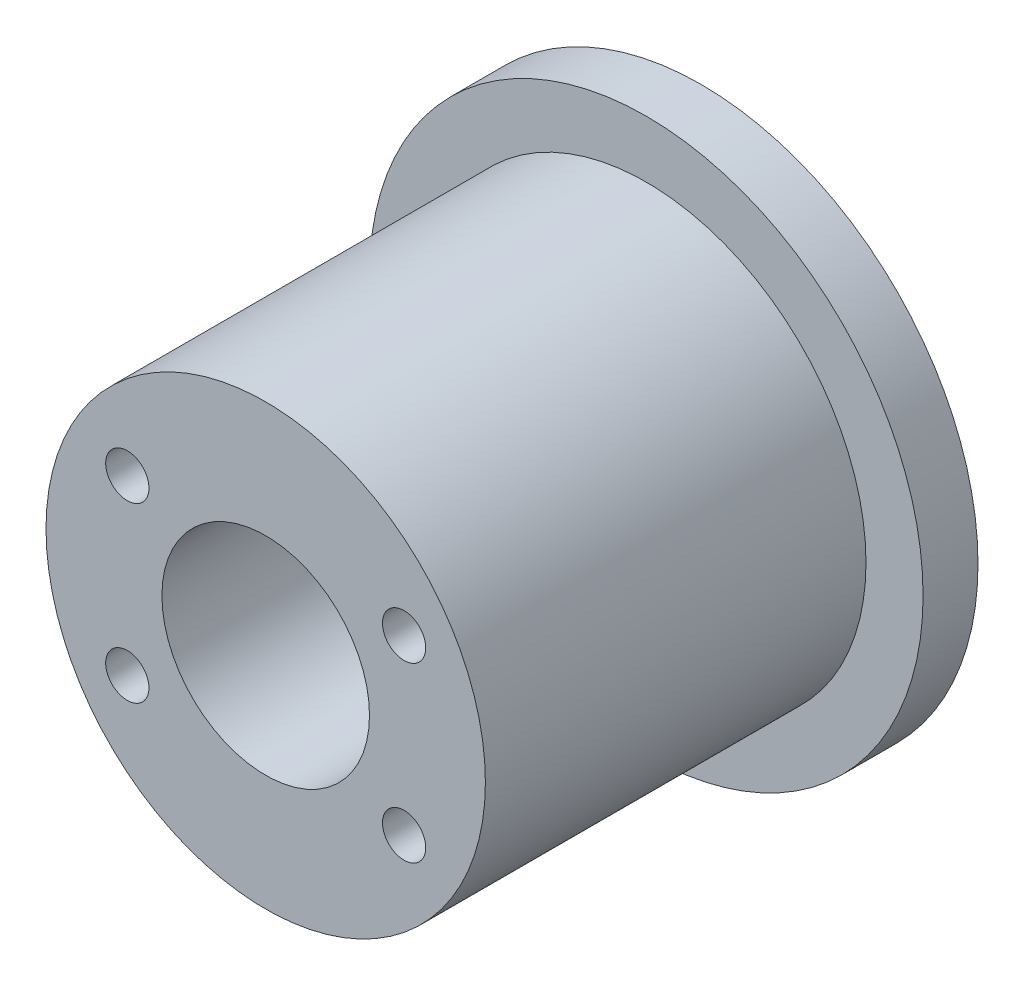
ISO-10303-21;
HEADER;
FILE_DESCRIPTION(('STEP AP214'),'2;1');
FILE_NAME('part.step','',(''),(''),'','','');
FILE_SCHEMA(('AUTOMOTIVE_DESIGN { 1 0 10303 214 1 1 1 1 }'));
ENDSEC;
DATA;
#1=APPLICATION_CONTEXT('core data for automotive mechanical design processes');
#2=APPLICATION_PROTOCOL_DEFINITION('international standard','automotive_design',2000,#1);
#3=PRODUCT_CONTEXT('',#1,'mechanical');
#4=PRODUCT('Part','Part','',(#3));
#5=PRODUCT_RELATED_PRODUCT_CATEGORY('part','',(#4));
#6=PRODUCT_DEFINITION_FORMATION('','',#4);
#7=PRODUCT_DEFINITION_CONTEXT('part definition',#1,'design');
#8=PRODUCT_DEFINITION('design','',#6,#7);
#9=PRODUCT_DEFINITION_SHAPE('','',#8);
#10=(LENGTH_UNIT() NAMED_UNIT(*) SI_UNIT(.MILLI.,.METRE.));
#11=(NAMED_UNIT(*) PLANE_ANGLE_UNIT() SI_UNIT($,.RADIAN.));
#12=(NAMED_UNIT(*) SI_UNIT($,.STERADIAN.) SOLID_ANGLE_UNIT());
#13=UNCERTAINTY_MEASURE_WITH_UNIT(LENGTH_MEASURE(1.E-05),#10,'distance_accuracy_value','');
#14=(GEOMETRIC_REPRESENTATION_CONTEXT(3) GLOBAL_UNCERTAINTY_ASSIGNED_CONTEXT((#13)) GLOBAL_UNIT_ASSIGNED_CONTEXT((#10,
#11,#12)) REPRESENTATION_CONTEXT('',''));
#15=CARTESIAN_POINT('',(0.,0.,0.));
#16=DIRECTION('',(0.,0.,1.));
#17=DIRECTION('',(1.,0.,0.));
#18=AXIS2_PLACEMENT_3D('',#15,#16,#17);
#19=CARTESIAN_POINT('',(0.,0.,11.));
#20=DIRECTION('',(0.,0.,1.));
#21=DIRECTION('',(1.,0.,0.));
#22=AXIS2_PLACEMENT_3D('',#19,#20,#21);
#23=PLANE('',#22);
#24=CARTESIAN_POINT('',(-8.,5.,11.));
#25=DIRECTION('',(0.,0.,1.));
#26=DIRECTION('',(1.,0.,0.));
#27=AXIS2_PLACEMENT_3D('',#24,#25,#26);
#28=CIRCLE('',#27,1.24999999999999);
#29=CARTESIAN_POINT('',(-6.75000000000002,5.,11.));
#30=VERTEX_POINT('',#29);
#31=EDGE_CURVE('E84',#30,#30,#28,.T.);
#32=ORIENTED_EDGE('',*,*,#31,.F.);
#33=EDGE_LOOP('',(#32));
#34=FACE_BOUND('',#33,.T.);
#35=CARTESIAN_POINT('',(-8.,-5.,11.));
#36=DIRECTION('',(0.,0.,1.));
#37=DIRECTION('',(1.,0.,0.));
#38=AXIS2_PLACEMENT_3D('',#35,#36,#37);
#39=CIRCLE('',#38,1.24999999999999);
#40=CARTESIAN_POINT('',(-6.75000000000001,-5.,11.));
#41=VERTEX_POINT('',#40);
#42=EDGE_CURVE('E83',#41,#41,#39,.T.);
#43=ORIENTED_EDGE('',*,*,#42,.F.);
#44=EDGE_LOOP('',(#43));
#45=FACE_BOUND('',#44,.T.);
#46=CARTESIAN_POINT('',(8.,-5.,11.));
#47=DIRECTION('',(0.,0.,1.));
#48=DIRECTION('',(1.,0.,0.));
#49=AXIS2_PLACEMENT_3D('',#46,#47,#48);
#50=CIRCLE('',#49,1.24999999999999);
#51=CARTESIAN_POINT('',(9.24999999999999,-5.,11.));
#52=VERTEX_POINT('',#51);
#53=EDGE_CURVE('E94',#52,#52,#50,.T.);
#54=ORIENTED_EDGE('',*,*,#53,.F.);
#55=EDGE_LOOP('',(#54));
#56=FACE_BOUND('',#55,.T.);
#57=CARTESIAN_POINT('',(8.,5.,11.));
#58=DIRECTION('',(0.,0.,1.));
#59=DIRECTION('',(1.,0.,0.));
#60=AXIS2_PLACEMENT_3D('',#57,#58,#59);
#61=CIRCLE('',#60,1.24999999999999);
#62=CARTESIAN_POINT('',(9.24999999999999,5.,11.));
#63=VERTEX_POINT('',#62);
#64=EDGE_CURVE('E100',#63,#63,#61,.T.);
#65=ORIENTED_EDGE('',*,*,#64,.F.);
#66=EDGE_LOOP('',(#65));
#67=FACE_BOUND('',#66,.T.);
#68=CARTESIAN_POINT('',(0.,0.,11.));
#69=DIRECTION('',(0.,0.,1.));
#70=DIRECTION('',(1.,0.,0.));
#71=AXIS2_PLACEMENT_3D('',#68,#69,#70);
#72=CIRCLE('',#71,12.7);
#73=CARTESIAN_POINT('',(12.7,0.,11.));
#74=VERTEX_POINT('',#73);
#75=EDGE_CURVE('E11',#74,#74,#72,.T.);
#76=ORIENTED_EDGE('',*,*,#75,.T.);
#77=EDGE_LOOP('',(#76));
#78=FACE_BOUND('',#77,.T.);
#79=CARTESIAN_POINT('',(0.,0.,11.));
#80=DIRECTION('',(0.,0.,1.));
#81=DIRECTION('',(1.,0.,0.));
#82=AXIS2_PLACEMENT_3D('',#79,#80,#81);
#83=CIRCLE('',#82,6.);
#84=CARTESIAN_POINT('',(6.,0.,11.));
#85=VERTEX_POINT('',#84);
#86=EDGE_CURVE('E60',#85,#85,#83,.T.);
#87=ORIENTED_EDGE('',*,*,#86,.F.);
#88=EDGE_LOOP('',(#87));
#89=FACE_BOUND('',#88,.T.);
#90=ADVANCED_FACE('F51',(#34,#45,#56,#67,#78,#89),#23,.T.);
#91=CARTESIAN_POINT('',(0.,0.,11.));
#92=DIRECTION('',(0.,0.,-1.));
#93=DIRECTION('',(-1.,0.,0.));
#94=AXIS2_PLACEMENT_3D('',#91,#92,#93);
#95=CYLINDRICAL_SURFACE('',#94,12.7);
#96=ORIENTED_EDGE('',*,*,#75,.F.);
#97=EDGE_LOOP('',(#96));
#98=FACE_BOUND('',#97,.T.);
#99=CARTESIAN_POINT('',(0.,0.,-11.));
#100=DIRECTION('',(0.,0.,1.));
#101=DIRECTION('',(1.,0.,0.));
#102=AXIS2_PLACEMENT_3D('',#99,#100,#101);
#103=CIRCLE('',#102,12.7);
#104=CARTESIAN_POINT('',(12.7,0.,-11.));
#105=VERTEX_POINT('',#104);
#106=EDGE_CURVE('E55',#105,#105,#103,.T.);
#107=ORIENTED_EDGE('',*,*,#106,.T.);
#108=EDGE_LOOP('',(#107));
#109=FACE_BOUND('',#108,.T.);
#110=ADVANCED_FACE('F53',(#98,#109),#95,.T.);
#111=CARTESIAN_POINT('',(0.,0.,11.));
#112=DIRECTION('',(0.,0.,-1.));
#113=DIRECTION('',(-1.,0.,0.));
#114=AXIS2_PLACEMENT_3D('',#111,#112,#113);
#115=CYLINDRICAL_SURFACE('',#114,6.);
#116=ORIENTED_EDGE('',*,*,#86,.T.);
#117=EDGE_LOOP('',(#116));
#118=FACE_BOUND('',#117,.T.);
#119=CARTESIAN_POINT('',(0.,0.,-14.175));
#120=DIRECTION('',(0.,0.,-1.));
#121=DIRECTION('',(-1.,0.,0.));
#122=AXIS2_PLACEMENT_3D('',#119,#120,#121);
#123=CIRCLE('',#122,6.);
#124=CARTESIAN_POINT('',(-6.,0.,-14.175));
#125=VERTEX_POINT('',#124);
#126=EDGE_CURVE('E106',#125,#125,#123,.T.);
#127=ORIENTED_EDGE('',*,*,#126,.T.);
#128=EDGE_LOOP('',(#127));
#129=FACE_BOUND('',#128,.T.);
#130=ADVANCED_FACE('F147',(#118,#129),#115,.F.);
#131=CARTESIAN_POINT('',(0.,0.,-14.175));
#132=DIRECTION('',(0.,0.,-1.));
#133=DIRECTION('',(-1.,0.,0.));
#134=AXIS2_PLACEMENT_3D('',#131,#132,#133);
#135=PLANE('',#134);
#136=CARTESIAN_POINT('',(0.,0.,-14.175));
#137=DIRECTION('',(0.,0.,-1.));
#138=DIRECTION('',(-1.,0.,0.));
#139=AXIS2_PLACEMENT_3D('',#136,#137,#138);
#140=CIRCLE('',#139,16.);
#141=CARTESIAN_POINT('',(-16.,0.,-14.175));
#142=VERTEX_POINT('',#141);
#143=EDGE_CURVE('E110',#142,#142,#140,.T.);
#144=ORIENTED_EDGE('',*,*,#143,.T.);
#145=EDGE_LOOP('',(#144));
#146=FACE_BOUND('',#145,.T.);
#147=ORIENTED_EDGE('',*,*,#126,.F.);
#148=EDGE_LOOP('',(#147));
#149=FACE_BOUND('',#148,.T.);
#150=ADVANCED_FACE('F126',(#146,#149),#135,.T.);
#151=CARTESIAN_POINT('',(0.,0.,-11.));
#152=DIRECTION('',(0.,0.,-1.));
#153=DIRECTION('',(-1.,0.,0.));
#154=AXIS2_PLACEMENT_3D('',#151,#152,#153);
#155=PLANE('',#154);
#156=ORIENTED_EDGE('',*,*,#106,.F.);
#157=EDGE_LOOP('',(#156));
#158=FACE_BOUND('',#157,.T.);
#159=CARTESIAN_POINT('',(0.,0.,-11.));
#160=DIRECTION('',(0.,0.,-1.));
#161=DIRECTION('',(-1.,0.,0.));
#162=AXIS2_PLACEMENT_3D('',#159,#160,#161);
#163=CIRCLE('',#162,16.);
#164=CARTESIAN_POINT('',(-16.,0.,-11.));
#165=VERTEX_POINT('',#164);
#166=EDGE_CURVE('E109',#165,#165,#163,.T.);
#167=ORIENTED_EDGE('',*,*,#166,.F.);
#168=EDGE_LOOP('',(#167));
#169=FACE_BOUND('',#168,.T.);
#170=ADVANCED_FACE('F122',(#158,#169),#155,.F.);
#171=CARTESIAN_POINT('',(0.,0.,-14.175));
#172=DIRECTION('',(0.,0.,1.));
#173=DIRECTION('',(1.,0.,0.));
#174=AXIS2_PLACEMENT_3D('',#171,#172,#173);
#175=CYLINDRICAL_SURFACE('',#174,16.);
#176=ORIENTED_EDGE('',*,*,#143,.F.);
#177=EDGE_LOOP('',(#176));
#178=FACE_BOUND('',#177,.T.);
#179=ORIENTED_EDGE('',*,*,#166,.T.);
#180=EDGE_LOOP('',(#179));
#181=FACE_BOUND('',#180,.T.);
#182=ADVANCED_FACE('F125',(#178,#181),#175,.T.);
#183=CARTESIAN_POINT('',(8.,5.,-4.));
#184=DIRECTION('',(0.,0.,1.));
#185=DIRECTION('',(1.,0.,0.));
#186=AXIS2_PLACEMENT_3D('',#183,#184,#185);
#187=CONICAL_SURFACE('',#186,1.25,1.02974425867665);
#188=CARTESIAN_POINT('',(8.,5.,-4.75107577378445));
#189=VERTEX_POINT('',#188);
#190=VERTEX_LOOP('',#189);
#191=FACE_BOUND('',#190,.T.);
#192=CARTESIAN_POINT('',(8.,5.,-4.));
#193=DIRECTION('',(0.,0.,1.));
#194=DIRECTION('',(1.,0.,0.));
#195=AXIS2_PLACEMENT_3D('',#192,#193,#194);
#196=CIRCLE('',#195,1.25);
#197=CARTESIAN_POINT('',(9.25,5.,-4.));
#198=VERTEX_POINT('',#197);
#199=EDGE_CURVE('E103',#198,#198,#196,.T.);
#200=ORIENTED_EDGE('',*,*,#199,.T.);
#201=EDGE_LOOP('',(#200));
#202=FACE_BOUND('',#201,.T.);
#203=ADVANCED_FACE('F131',(#191,#202),#187,.F.);
#204=CARTESIAN_POINT('',(8.,5.,11.));
#205=DIRECTION('',(0.,0.,1.));
#206=DIRECTION('',(1.,0.,0.));
#207=AXIS2_PLACEMENT_3D('',#204,#205,#206);
#208=CYLINDRICAL_SURFACE('',#207,1.24999999999999);
#209=ORIENTED_EDGE('',*,*,#199,.F.);
#210=EDGE_LOOP('',(#209));
#211=FACE_BOUND('',#210,.T.);
#212=ORIENTED_EDGE('',*,*,#64,.T.);
#213=EDGE_LOOP('',(#212));
#214=FACE_BOUND('',#213,.T.);
#215=ADVANCED_FACE('F138',(#211,#214),#208,.F.);
#216=CARTESIAN_POINT('',(8.,-5.,-4.));
#217=DIRECTION('',(0.,0.,1.));
#218=DIRECTION('',(1.,0.,0.));
#219=AXIS2_PLACEMENT_3D('',#216,#217,#218);
#220=CONICAL_SURFACE('',#219,1.25,1.02974425867665);
#221=CARTESIAN_POINT('',(8.,-5.,-4.75107577378445));
#222=VERTEX_POINT('',#221);
#223=VERTEX_LOOP('',#222);
#224=FACE_BOUND('',#223,.T.);
#225=CARTESIAN_POINT('',(8.,-5.,-4.));
#226=DIRECTION('',(0.,0.,1.));
#227=DIRECTION('',(1.,0.,0.));
#228=AXIS2_PLACEMENT_3D('',#225,#226,#227);
#229=CIRCLE('',#228,1.25);
#230=CARTESIAN_POINT('',(9.25,-5.,-4.));
#231=VERTEX_POINT('',#230);
#232=EDGE_CURVE('E97',#231,#231,#229,.T.);
#233=ORIENTED_EDGE('',*,*,#232,.T.);
#234=EDGE_LOOP('',(#233));
#235=FACE_BOUND('',#234,.T.);
#236=ADVANCED_FACE('F165',(#224,#235),#220,.F.);
#237=CARTESIAN_POINT('',(8.,-5.,11.));
#238=DIRECTION('',(0.,0.,1.));
#239=DIRECTION('',(1.,0.,0.));
#240=AXIS2_PLACEMENT_3D('',#237,#238,#239);
#241=CYLINDRICAL_SURFACE('',#240,1.24999999999999);
#242=ORIENTED_EDGE('',*,*,#232,.F.);
#243=EDGE_LOOP('',(#242));
#244=FACE_BOUND('',#243,.T.);
#245=ORIENTED_EDGE('',*,*,#53,.T.);
#246=EDGE_LOOP('',(#245));
#247=FACE_BOUND('',#246,.T.);
#248=ADVANCED_FACE('F169',(#244,#247),#241,.F.);
#249=CARTESIAN_POINT('',(-8.,-5.,-4.));
#250=DIRECTION('',(0.,0.,1.));
#251=DIRECTION('',(1.,0.,0.));
#252=AXIS2_PLACEMENT_3D('',#249,#250,#251);
#253=CONICAL_SURFACE('',#252,1.25,1.02974425867665);
#254=CARTESIAN_POINT('',(-8.,-5.,-4.75107577378445));
#255=VERTEX_POINT('',#254);
#256=VERTEX_LOOP('',#255);
#257=FACE_BOUND('',#256,.T.);
#258=CARTESIAN_POINT('',(-8.,-5.,-4.));
#259=DIRECTION('',(0.,0.,1.));
#260=DIRECTION('',(1.,0.,0.));
#261=AXIS2_PLACEMENT_3D('',#258,#259,#260);
#262=CIRCLE('',#261,1.25);
#263=CARTESIAN_POINT('',(-6.75,-5.,-4.));
#264=VERTEX_POINT('',#263);
#265=EDGE_CURVE('E87',#264,#264,#262,.T.);
#266=ORIENTED_EDGE('',*,*,#265,.T.);
#267=EDGE_LOOP('',(#266));
#268=FACE_BOUND('',#267,.T.);
#269=ADVANCED_FACE('F172',(#257,#268),#253,.F.);
#270=CARTESIAN_POINT('',(-8.,-5.,11.));
#271=DIRECTION('',(0.,0.,1.));
#272=DIRECTION('',(1.,0.,0.));
#273=AXIS2_PLACEMENT_3D('',#270,#271,#272);
#274=CYLINDRICAL_SURFACE('',#273,1.24999999999999);
#275=ORIENTED_EDGE('',*,*,#265,.F.);
#276=EDGE_LOOP('',(#275));
#277=FACE_BOUND('',#276,.T.);
#278=ORIENTED_EDGE('',*,*,#42,.T.);
#279=EDGE_LOOP('',(#278));
#280=FACE_BOUND('',#279,.T.);
#281=ADVANCED_FACE('F77',(#277,#280),#274,.F.);
#282=CARTESIAN_POINT('',(-8.,5.,-4.));
#283=DIRECTION('',(0.,0.,1.));
#284=DIRECTION('',(1.,0.,0.));
#285=AXIS2_PLACEMENT_3D('',#282,#283,#284);
#286=CONICAL_SURFACE('',#285,1.25,1.02974425867665);
#287=CARTESIAN_POINT('',(-8.00000000000001,5.,-4.75107577378445));
#288=VERTEX_POINT('',#287);
#289=VERTEX_LOOP('',#288);
#290=FACE_BOUND('',#289,.T.);
#291=CARTESIAN_POINT('',(-8.,5.,-4.));
#292=DIRECTION('',(0.,0.,1.));
#293=DIRECTION('',(1.,0.,0.));
#294=AXIS2_PLACEMENT_3D('',#291,#292,#293);
#295=CIRCLE('',#294,1.25);
#296=CARTESIAN_POINT('',(-6.75000000000001,5.,-4.));
#297=VERTEX_POINT('',#296);
#298=EDGE_CURVE('E81',#297,#297,#295,.T.);
#299=ORIENTED_EDGE('',*,*,#298,.T.);
#300=EDGE_LOOP('',(#299));
#301=FACE_BOUND('',#300,.T.);
#302=ADVANCED_FACE('F73',(#290,#301),#286,.F.);
#303=CARTESIAN_POINT('',(-8.,5.,11.));
#304=DIRECTION('',(0.,0.,1.));
#305=DIRECTION('',(1.,0.,0.));
#306=AXIS2_PLACEMENT_3D('',#303,#304,#305);
#307=CYLINDRICAL_SURFACE('',#306,1.24999999999999);
#308=ORIENTED_EDGE('',*,*,#298,.F.);
#309=EDGE_LOOP('',(#308));
#310=FACE_BOUND('',#309,.T.);
#311=ORIENTED_EDGE('',*,*,#31,.T.);
#312=EDGE_LOOP('',(#311));
#313=FACE_BOUND('',#312,.T.);
#314=ADVANCED_FACE('F76',(#310,#313),#307,.F.);
#315=CLOSED_SHELL('',(#90,#110,#130,#150,#170,#182,#203,#215,#236,#248,#269,#281,#302,#314));
#316=MANIFOLD_SOLID_BREP('B2',#315);
#317=ADVANCED_BREP_SHAPE_REPRESENTATION('',(#18,#316),#14);
#318=SHAPE_DEFINITION_REPRESENTATION(#9,#317);
ENDSEC;
END-ISO-10303-21;
